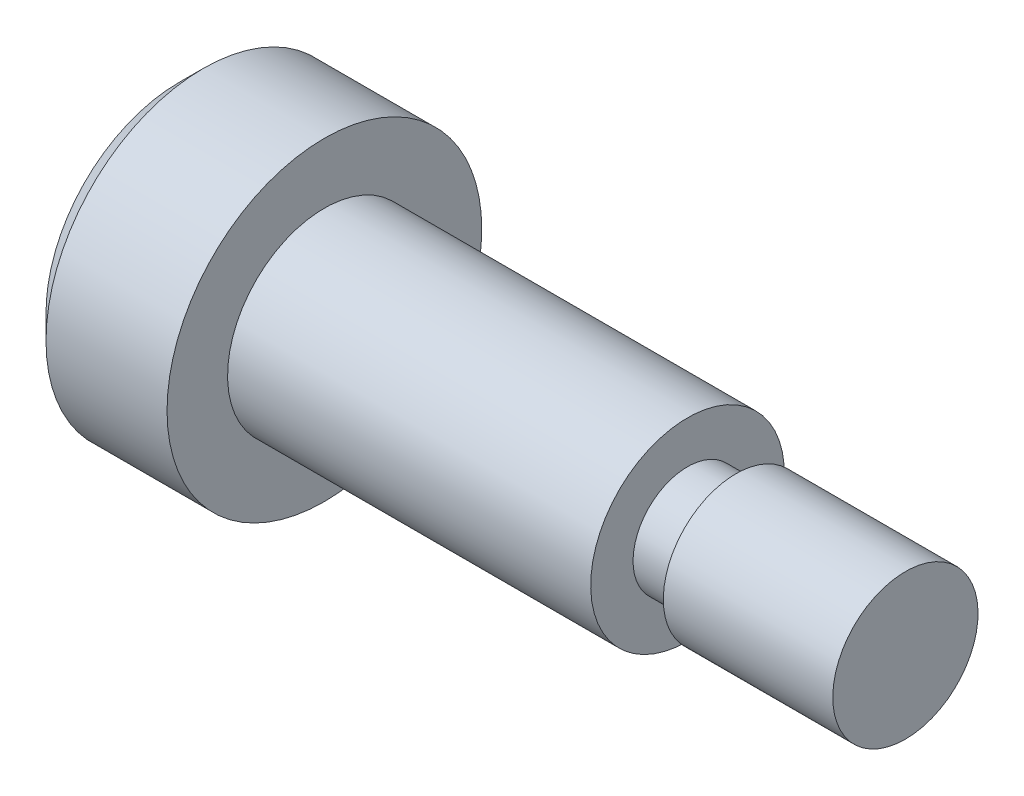
ISO-10303-21;
HEADER;
FILE_DESCRIPTION(('STEP AP214'),'2;1');
FILE_NAME('part.step','',(''),(''),'','','');
FILE_SCHEMA(('AUTOMOTIVE_DESIGN { 1 0 10303 214 1 1 1 1 }'));
ENDSEC;
DATA;
#1=APPLICATION_CONTEXT('core data for automotive mechanical design processes');
#2=APPLICATION_PROTOCOL_DEFINITION('international standard','automotive_design',2000,#1);
#3=PRODUCT_CONTEXT('',#1,'mechanical');
#4=PRODUCT('Part','Part','',(#3));
#5=PRODUCT_RELATED_PRODUCT_CATEGORY('part','',(#4));
#6=PRODUCT_DEFINITION_FORMATION('','',#4);
#7=PRODUCT_DEFINITION_CONTEXT('part definition',#1,'design');
#8=PRODUCT_DEFINITION('design','',#6,#7);
#9=PRODUCT_DEFINITION_SHAPE('','',#8);
#10=(LENGTH_UNIT() NAMED_UNIT(*) SI_UNIT(.MILLI.,.METRE.));
#11=(NAMED_UNIT(*) PLANE_ANGLE_UNIT() SI_UNIT($,.RADIAN.));
#12=(NAMED_UNIT(*) SI_UNIT($,.STERADIAN.) SOLID_ANGLE_UNIT());
#13=UNCERTAINTY_MEASURE_WITH_UNIT(LENGTH_MEASURE(1.E-05),#10,'distance_accuracy_value','');
#14=(GEOMETRIC_REPRESENTATION_CONTEXT(3) GLOBAL_UNCERTAINTY_ASSIGNED_CONTEXT((#13)) GLOBAL_UNIT_ASSIGNED_CONTEXT((#10,
#11,#12)) REPRESENTATION_CONTEXT('',''));
#15=CARTESIAN_POINT('',(0.,0.,0.));
#16=DIRECTION('',(0.,0.,1.));
#17=DIRECTION('',(1.,0.,0.));
#18=AXIS2_PLACEMENT_3D('',#15,#16,#17);
#19=CARTESIAN_POINT('',(-6.,0.,0.));
#20=DIRECTION('',(1.,0.,0.));
#21=DIRECTION('',(0.,1.,0.));
#22=AXIS2_PLACEMENT_3D('',#19,#20,#21);
#23=PLANE('',#22);
#24=CARTESIAN_POINT('',(-6.,0.,0.));
#25=DIRECTION('',(1.,0.,0.));
#26=DIRECTION('',(0.,1.,0.));
#27=AXIS2_PLACEMENT_3D('',#24,#25,#26);
#28=CIRCLE('',#27,5.5);
#29=CARTESIAN_POINT('',(-6.,5.5,0.));
#30=VERTEX_POINT('',#29);
#31=EDGE_CURVE('E40',#30,#30,#28,.F.);
#32=ORIENTED_EDGE('',*,*,#31,.T.);
#33=EDGE_LOOP('',(#32));
#34=FACE_BOUND('',#33,.T.);
#35=DIRECTION('',(0.,0.866025403784438,-0.5));
#36=VECTOR('',#35,1.);
#37=CARTESIAN_POINT('',(-6.,0.,2.88675134594813));
#38=LINE('',#37,#36);
#39=CARTESIAN_POINT('',(-6.,0.,2.88675134594813));
#40=VERTEX_POINT('',#39);
#41=CARTESIAN_POINT('',(-6.,2.5,1.44337567297406));
#42=VERTEX_POINT('',#41);
#43=EDGE_CURVE('E121',#40,#42,#38,.T.);
#44=ORIENTED_EDGE('',*,*,#43,.F.);
#45=DIRECTION('',(0.,0.866025403784438,0.5));
#46=VECTOR('',#45,1.);
#47=CARTESIAN_POINT('',(-6.,-2.5,1.44337567297406));
#48=LINE('',#47,#46);
#49=CARTESIAN_POINT('',(-6.,-2.5,1.44337567297406));
#50=VERTEX_POINT('',#49);
#51=EDGE_CURVE('E47',#50,#40,#48,.T.);
#52=ORIENTED_EDGE('',*,*,#51,.F.);
#53=DIRECTION('',(0.,0.,1.));
#54=VECTOR('',#53,1.);
#55=CARTESIAN_POINT('',(-6.,-2.5,-1.44337567297407));
#56=LINE('',#55,#54);
#57=CARTESIAN_POINT('',(-6.,-2.5,-1.44337567297407));
#58=VERTEX_POINT('',#57);
#59=EDGE_CURVE('E130',#58,#50,#56,.T.);
#60=ORIENTED_EDGE('',*,*,#59,.F.);
#61=DIRECTION('',(0.,-0.866025403784439,0.5));
#62=VECTOR('',#61,1.);
#63=CARTESIAN_POINT('',(-6.,0.,-2.88675134594813));
#64=LINE('',#63,#62);
#65=CARTESIAN_POINT('',(-6.,0.,-2.88675134594813));
#66=VERTEX_POINT('',#65);
#67=EDGE_CURVE('E128',#66,#58,#64,.T.);
#68=ORIENTED_EDGE('',*,*,#67,.F.);
#69=DIRECTION('',(0.,-0.866025403784439,-0.5));
#70=VECTOR('',#69,1.);
#71=CARTESIAN_POINT('',(-6.,2.5,-1.44337567297407));
#72=LINE('',#71,#70);
#73=CARTESIAN_POINT('',(-6.,2.5,-1.44337567297407));
#74=VERTEX_POINT('',#73);
#75=EDGE_CURVE('E95',#74,#66,#72,.T.);
#76=ORIENTED_EDGE('',*,*,#75,.F.);
#77=DIRECTION('',(0.,0.,-1.));
#78=VECTOR('',#77,1.);
#79=CARTESIAN_POINT('',(-6.,2.5,1.44337567297406));
#80=LINE('',#79,#78);
#81=EDGE_CURVE('E124',#42,#74,#80,.T.);
#82=ORIENTED_EDGE('',*,*,#81,.F.);
#83=EDGE_LOOP('',(#44,#52,#60,#68,#76,#82));
#84=FACE_BOUND('',#83,.T.);
#85=ADVANCED_FACE('F32',(#34,#84),#23,.F.);
#86=CARTESIAN_POINT('',(-26.0125543283678,0.,0.));
#87=DIRECTION('',(-1.,0.,0.));
#88=DIRECTION('',(0.,-1.,0.));
#89=AXIS2_PLACEMENT_3D('',#86,#87,#88);
#90=CYLINDRICAL_SURFACE('',#89,6.5);
#91=CARTESIAN_POINT('',(-4.99999999999999,0.,0.));
#92=DIRECTION('',(1.,0.,0.));
#93=DIRECTION('',(0.,1.,0.));
#94=AXIS2_PLACEMENT_3D('',#91,#92,#93);
#95=CIRCLE('',#94,6.5);
#96=CARTESIAN_POINT('',(-4.99999999999999,6.5,0.));
#97=VERTEX_POINT('',#96);
#98=EDGE_CURVE('E11',#97,#97,#95,.T.);
#99=ORIENTED_EDGE('',*,*,#98,.T.);
#100=EDGE_LOOP('',(#99));
#101=FACE_BOUND('',#100,.T.);
#102=CARTESIAN_POINT('',(0.,0.,0.));
#103=DIRECTION('',(-1.,0.,0.));
#104=DIRECTION('',(0.,-1.,0.));
#105=AXIS2_PLACEMENT_3D('',#102,#103,#104);
#106=CIRCLE('',#105,6.5);
#107=CARTESIAN_POINT('',(0.,-6.5,0.));
#108=VERTEX_POINT('',#107);
#109=EDGE_CURVE('E157',#108,#108,#106,.T.);
#110=ORIENTED_EDGE('',*,*,#109,.T.);
#111=EDGE_LOOP('',(#110));
#112=FACE_BOUND('',#111,.T.);
#113=ADVANCED_FACE('F173',(#101,#112),#90,.T.);
#114=CARTESIAN_POINT('',(0.,6.5,0.));
#115=DIRECTION('',(-1.,0.,0.));
#116=DIRECTION('',(0.,-1.,0.));
#117=AXIS2_PLACEMENT_3D('',#114,#115,#116);
#118=PLANE('',#117);
#119=ORIENTED_EDGE('',*,*,#109,.F.);
#120=EDGE_LOOP('',(#119));
#121=FACE_BOUND('',#120,.T.);
#122=CARTESIAN_POINT('',(0.,0.,0.));
#123=DIRECTION('',(-1.,0.,0.));
#124=DIRECTION('',(0.,-1.,0.));
#125=AXIS2_PLACEMENT_3D('',#122,#123,#124);
#126=CIRCLE('',#125,4.);
#127=CARTESIAN_POINT('',(0.,-4.,0.));
#128=VERTEX_POINT('',#127);
#129=EDGE_CURVE('E154',#128,#128,#126,.T.);
#130=ORIENTED_EDGE('',*,*,#129,.T.);
#131=EDGE_LOOP('',(#130));
#132=FACE_BOUND('',#131,.T.);
#133=ADVANCED_FACE('F177',(#121,#132),#118,.F.);
#134=CARTESIAN_POINT('',(-26.0125543283678,0.,0.));
#135=DIRECTION('',(-1.,0.,0.));
#136=DIRECTION('',(0.,-1.,0.));
#137=AXIS2_PLACEMENT_3D('',#134,#135,#136);
#138=CYLINDRICAL_SURFACE('',#137,4.);
#139=ORIENTED_EDGE('',*,*,#129,.F.);
#140=EDGE_LOOP('',(#139));
#141=FACE_BOUND('',#140,.T.);
#142=CARTESIAN_POINT('',(15.,0.,0.));
#143=DIRECTION('',(-1.,0.,0.));
#144=DIRECTION('',(0.,-1.,0.));
#145=AXIS2_PLACEMENT_3D('',#142,#143,#144);
#146=CIRCLE('',#145,4.);
#147=CARTESIAN_POINT('',(15.,-4.,0.));
#148=VERTEX_POINT('',#147);
#149=EDGE_CURVE('E151',#148,#148,#146,.T.);
#150=ORIENTED_EDGE('',*,*,#149,.T.);
#151=EDGE_LOOP('',(#150));
#152=FACE_BOUND('',#151,.T.);
#153=ADVANCED_FACE('F183',(#141,#152),#138,.T.);
#154=CARTESIAN_POINT('',(15.,4.,0.));
#155=DIRECTION('',(-1.,0.,0.));
#156=DIRECTION('',(0.,-1.,0.));
#157=AXIS2_PLACEMENT_3D('',#154,#155,#156);
#158=PLANE('',#157);
#159=ORIENTED_EDGE('',*,*,#149,.F.);
#160=EDGE_LOOP('',(#159));
#161=FACE_BOUND('',#160,.T.);
#162=CARTESIAN_POINT('',(15.,0.,0.));
#163=DIRECTION('',(-1.,0.,0.));
#164=DIRECTION('',(0.,-1.,0.));
#165=AXIS2_PLACEMENT_3D('',#162,#163,#164);
#166=CIRCLE('',#165,2.25);
#167=CARTESIAN_POINT('',(15.,-2.25,0.));
#168=VERTEX_POINT('',#167);
#169=EDGE_CURVE('E148',#168,#168,#166,.T.);
#170=ORIENTED_EDGE('',*,*,#169,.T.);
#171=EDGE_LOOP('',(#170));
#172=FACE_BOUND('',#171,.T.);
#173=ADVANCED_FACE('F187',(#161,#172),#158,.F.);
#174=CARTESIAN_POINT('',(-26.0125543283678,0.,0.));
#175=DIRECTION('',(-1.,0.,0.));
#176=DIRECTION('',(0.,-1.,0.));
#177=AXIS2_PLACEMENT_3D('',#174,#175,#176);
#178=CYLINDRICAL_SURFACE('',#177,2.25);
#179=ORIENTED_EDGE('',*,*,#169,.F.);
#180=EDGE_LOOP('',(#179));
#181=FACE_BOUND('',#180,.T.);
#182=CARTESIAN_POINT('',(17.,0.,0.));
#183=DIRECTION('',(-1.,0.,0.));
#184=DIRECTION('',(0.,-1.,0.));
#185=AXIS2_PLACEMENT_3D('',#182,#183,#184);
#186=CIRCLE('',#185,2.25);
#187=CARTESIAN_POINT('',(17.,-2.25,0.));
#188=VERTEX_POINT('',#187);
#189=EDGE_CURVE('E145',#188,#188,#186,.T.);
#190=ORIENTED_EDGE('',*,*,#189,.T.);
#191=EDGE_LOOP('',(#190));
#192=FACE_BOUND('',#191,.T.);
#193=ADVANCED_FACE('F191',(#181,#192),#178,.T.);
#194=CARTESIAN_POINT('',(17.,2.25,0.));
#195=DIRECTION('',(1.,0.,0.));
#196=DIRECTION('',(0.,1.,0.));
#197=AXIS2_PLACEMENT_3D('',#194,#195,#196);
#198=PLANE('',#197);
#199=ORIENTED_EDGE('',*,*,#189,.F.);
#200=EDGE_LOOP('',(#199));
#201=FACE_BOUND('',#200,.T.);
#202=CARTESIAN_POINT('',(17.,0.,0.));
#203=DIRECTION('',(-1.,0.,0.));
#204=DIRECTION('',(0.,-1.,0.));
#205=AXIS2_PLACEMENT_3D('',#202,#203,#204);
#206=CIRCLE('',#205,3.);
#207=CARTESIAN_POINT('',(17.,-3.,0.));
#208=VERTEX_POINT('',#207);
#209=EDGE_CURVE('E142',#208,#208,#206,.T.);
#210=ORIENTED_EDGE('',*,*,#209,.T.);
#211=EDGE_LOOP('',(#210));
#212=FACE_BOUND('',#211,.T.);
#213=ADVANCED_FACE('F195',(#201,#212),#198,.F.);
#214=CARTESIAN_POINT('',(-26.0125543283678,0.,0.));
#215=DIRECTION('',(-1.,0.,0.));
#216=DIRECTION('',(0.,-1.,0.));
#217=AXIS2_PLACEMENT_3D('',#214,#215,#216);
#218=CYLINDRICAL_SURFACE('',#217,3.);
#219=ORIENTED_EDGE('',*,*,#209,.F.);
#220=EDGE_LOOP('',(#219));
#221=FACE_BOUND('',#220,.T.);
#222=CARTESIAN_POINT('',(24.,0.,0.));
#223=DIRECTION('',(-1.,0.,0.));
#224=DIRECTION('',(0.,-1.,0.));
#225=AXIS2_PLACEMENT_3D('',#222,#223,#224);
#226=CIRCLE('',#225,3.);
#227=CARTESIAN_POINT('',(24.,-3.,0.));
#228=VERTEX_POINT('',#227);
#229=EDGE_CURVE('E134',#228,#228,#226,.T.);
#230=ORIENTED_EDGE('',*,*,#229,.T.);
#231=EDGE_LOOP('',(#230));
#232=FACE_BOUND('',#231,.T.);
#233=ADVANCED_FACE('F199',(#221,#232),#218,.T.);
#234=CARTESIAN_POINT('',(24.,3.,0.));
#235=DIRECTION('',(-1.,0.,0.));
#236=DIRECTION('',(0.,-1.,0.));
#237=AXIS2_PLACEMENT_3D('',#234,#235,#236);
#238=PLANE('',#237);
#239=ORIENTED_EDGE('',*,*,#229,.F.);
#240=EDGE_LOOP('',(#239));
#241=FACE_BOUND('',#240,.T.);
#242=ADVANCED_FACE('F203',(#241),#238,.F.);
#243=CARTESIAN_POINT('',(-3.,-2.5,1.44337567297406));
#244=DIRECTION('',(0.,-0.5,0.866025403784439));
#245=DIRECTION('',(0.,-0.866025403784439,-0.5));
#246=AXIS2_PLACEMENT_3D('',#243,#244,#245);
#247=PLANE('',#246);
#248=ORIENTED_EDGE('',*,*,#51,.T.);
#249=DIRECTION('',(-1.,0.,0.));
#250=VECTOR('',#249,1.);
#251=CARTESIAN_POINT('',(-3.,0.,2.88675134594813));
#252=LINE('',#251,#250);
#253=CARTESIAN_POINT('',(-3.,0.,2.88675134594813));
#254=VERTEX_POINT('',#253);
#255=EDGE_CURVE('E77',#254,#40,#252,.T.);
#256=ORIENTED_EDGE('',*,*,#255,.F.);
#257=DIRECTION('',(0.,0.866025403784438,0.5));
#258=VECTOR('',#257,1.);
#259=CARTESIAN_POINT('',(-3.,-2.5,1.44337567297406));
#260=LINE('',#259,#258);
#261=CARTESIAN_POINT('',(-3.,-2.5,1.44337567297406));
#262=VERTEX_POINT('',#261);
#263=EDGE_CURVE('E132',#262,#254,#260,.T.);
#264=ORIENTED_EDGE('',*,*,#263,.F.);
#265=DIRECTION('',(-1.,0.,0.));
#266=VECTOR('',#265,1.);
#267=CARTESIAN_POINT('',(-3.,-2.5,1.44337567297406));
#268=LINE('',#267,#266);
#269=EDGE_CURVE('E55',#262,#50,#268,.T.);
#270=ORIENTED_EDGE('',*,*,#269,.T.);
#271=EDGE_LOOP('',(#248,#256,#264,#270));
#272=FACE_BOUND('',#271,.T.);
#273=ADVANCED_FACE('F207',(#272),#247,.F.);
#274=CARTESIAN_POINT('',(-3.,-2.5,-1.44337567297407));
#275=DIRECTION('',(0.,-1.,0.));
#276=DIRECTION('',(0.,0.,-1.));
#277=AXIS2_PLACEMENT_3D('',#274,#275,#276);
#278=PLANE('',#277);
#279=ORIENTED_EDGE('',*,*,#59,.T.);
#280=ORIENTED_EDGE('',*,*,#269,.F.);
#281=DIRECTION('',(0.,0.,1.));
#282=VECTOR('',#281,1.);
#283=CARTESIAN_POINT('',(-3.,-2.5,-1.44337567297407));
#284=LINE('',#283,#282);
#285=CARTESIAN_POINT('',(-3.,-2.5,-1.44337567297407));
#286=VERTEX_POINT('',#285);
#287=EDGE_CURVE('E107',#286,#262,#284,.T.);
#288=ORIENTED_EDGE('',*,*,#287,.F.);
#289=DIRECTION('',(-1.,0.,0.));
#290=VECTOR('',#289,1.);
#291=CARTESIAN_POINT('',(-3.,-2.5,-1.44337567297407));
#292=LINE('',#291,#290);
#293=EDGE_CURVE('E99',#286,#58,#292,.T.);
#294=ORIENTED_EDGE('',*,*,#293,.T.);
#295=EDGE_LOOP('',(#279,#280,#288,#294));
#296=FACE_BOUND('',#295,.T.);
#297=ADVANCED_FACE('F211',(#296),#278,.F.);
#298=CARTESIAN_POINT('',(-3.,0.,-2.88675134594813));
#299=DIRECTION('',(0.,-0.5,-0.866025403784439));
#300=DIRECTION('',(0.,0.866025403784439,-0.5));
#301=AXIS2_PLACEMENT_3D('',#298,#299,#300);
#302=PLANE('',#301);
#303=ORIENTED_EDGE('',*,*,#67,.T.);
#304=ORIENTED_EDGE('',*,*,#293,.F.);
#305=DIRECTION('',(0.,-0.866025403784439,0.5));
#306=VECTOR('',#305,1.);
#307=CARTESIAN_POINT('',(-3.,0.,-2.88675134594813));
#308=LINE('',#307,#306);
#309=CARTESIAN_POINT('',(-3.,0.,-2.88675134594813));
#310=VERTEX_POINT('',#309);
#311=EDGE_CURVE('E103',#310,#286,#308,.T.);
#312=ORIENTED_EDGE('',*,*,#311,.F.);
#313=DIRECTION('',(-1.,0.,0.));
#314=VECTOR('',#313,1.);
#315=CARTESIAN_POINT('',(-3.,0.,-2.88675134594813));
#316=LINE('',#315,#314);
#317=EDGE_CURVE('E88',#310,#66,#316,.T.);
#318=ORIENTED_EDGE('',*,*,#317,.T.);
#319=EDGE_LOOP('',(#303,#304,#312,#318));
#320=FACE_BOUND('',#319,.T.);
#321=ADVANCED_FACE('F104',(#320),#302,.F.);
#322=CARTESIAN_POINT('',(-3.,2.5,-1.44337567297407));
#323=DIRECTION('',(0.,0.5,-0.866025403784439));
#324=DIRECTION('',(0.,0.866025403784439,0.5));
#325=AXIS2_PLACEMENT_3D('',#322,#323,#324);
#326=PLANE('',#325);
#327=ORIENTED_EDGE('',*,*,#75,.T.);
#328=ORIENTED_EDGE('',*,*,#317,.F.);
#329=DIRECTION('',(0.,-0.866025403784439,-0.5));
#330=VECTOR('',#329,1.);
#331=CARTESIAN_POINT('',(-3.,2.5,-1.44337567297407));
#332=LINE('',#331,#330);
#333=CARTESIAN_POINT('',(-3.,2.5,-1.44337567297407));
#334=VERTEX_POINT('',#333);
#335=EDGE_CURVE('E92',#334,#310,#332,.T.);
#336=ORIENTED_EDGE('',*,*,#335,.F.);
#337=DIRECTION('',(-1.,0.,0.));
#338=VECTOR('',#337,1.);
#339=CARTESIAN_POINT('',(-3.,2.5,-1.44337567297407));
#340=LINE('',#339,#338);
#341=EDGE_CURVE('E100',#334,#74,#340,.T.);
#342=ORIENTED_EDGE('',*,*,#341,.T.);
#343=EDGE_LOOP('',(#327,#328,#336,#342));
#344=FACE_BOUND('',#343,.T.);
#345=ADVANCED_FACE('F90',(#344),#326,.F.);
#346=CARTESIAN_POINT('',(-3.,2.5,1.44337567297406));
#347=DIRECTION('',(0.,1.,0.));
#348=DIRECTION('',(0.,0.,1.));
#349=AXIS2_PLACEMENT_3D('',#346,#347,#348);
#350=PLANE('',#349);
#351=ORIENTED_EDGE('',*,*,#81,.T.);
#352=ORIENTED_EDGE('',*,*,#341,.F.);
#353=DIRECTION('',(0.,0.,-1.));
#354=VECTOR('',#353,1.);
#355=CARTESIAN_POINT('',(-3.,2.5,1.44337567297406));
#356=LINE('',#355,#354);
#357=CARTESIAN_POINT('',(-3.,2.5,1.44337567297406));
#358=VERTEX_POINT('',#357);
#359=EDGE_CURVE('E113',#358,#334,#356,.T.);
#360=ORIENTED_EDGE('',*,*,#359,.F.);
#361=DIRECTION('',(-1.,0.,0.));
#362=VECTOR('',#361,1.);
#363=CARTESIAN_POINT('',(-3.,2.5,1.44337567297406));
#364=LINE('',#363,#362);
#365=EDGE_CURVE('E137',#358,#42,#364,.T.);
#366=ORIENTED_EDGE('',*,*,#365,.T.);
#367=EDGE_LOOP('',(#351,#352,#360,#366));
#368=FACE_BOUND('',#367,.T.);
#369=ADVANCED_FACE('F214',(#368),#350,.F.);
#370=CARTESIAN_POINT('',(-3.,0.,2.88675134594813));
#371=DIRECTION('',(0.,0.5,0.866025403784439));
#372=DIRECTION('',(0.,-0.866025403784439,0.5));
#373=AXIS2_PLACEMENT_3D('',#370,#371,#372);
#374=PLANE('',#373);
#375=ORIENTED_EDGE('',*,*,#43,.T.);
#376=ORIENTED_EDGE('',*,*,#365,.F.);
#377=DIRECTION('',(0.,0.866025403784438,-0.5));
#378=VECTOR('',#377,1.);
#379=CARTESIAN_POINT('',(-3.,0.,2.88675134594813));
#380=LINE('',#379,#378);
#381=EDGE_CURVE('E115',#254,#358,#380,.T.);
#382=ORIENTED_EDGE('',*,*,#381,.F.);
#383=ORIENTED_EDGE('',*,*,#255,.T.);
#384=EDGE_LOOP('',(#375,#376,#382,#383));
#385=FACE_BOUND('',#384,.T.);
#386=ADVANCED_FACE('F169',(#385),#374,.F.);
#387=CARTESIAN_POINT('',(-3.,0.,2.88675134594813));
#388=DIRECTION('',(-1.,0.,0.));
#389=DIRECTION('',(0.,0.,1.));
#390=AXIS2_PLACEMENT_3D('',#387,#388,#389);
#391=PLANE('',#390);
#392=ORIENTED_EDGE('',*,*,#263,.T.);
#393=ORIENTED_EDGE('',*,*,#381,.T.);
#394=ORIENTED_EDGE('',*,*,#359,.T.);
#395=ORIENTED_EDGE('',*,*,#335,.T.);
#396=ORIENTED_EDGE('',*,*,#311,.T.);
#397=ORIENTED_EDGE('',*,*,#287,.T.);
#398=EDGE_LOOP('',(#392,#393,#394,#395,#396,#397));
#399=FACE_BOUND('',#398,.T.);
#400=ADVANCED_FACE('F110',(#399),#391,.T.);
#401=CARTESIAN_POINT('',(-6.,0.,0.));
#402=DIRECTION('',(1.,0.,0.));
#403=DIRECTION('',(0.,1.,0.));
#404=AXIS2_PLACEMENT_3D('',#401,#402,#403);
#405=CONICAL_SURFACE('',#404,5.5,0.785398163397447);
#406=ORIENTED_EDGE('',*,*,#98,.F.);
#407=EDGE_LOOP('',(#406));
#408=FACE_BOUND('',#407,.T.);
#409=ORIENTED_EDGE('',*,*,#31,.F.);
#410=EDGE_LOOP('',(#409));
#411=FACE_BOUND('',#410,.T.);
#412=ADVANCED_FACE('F34',(#408,#411),#405,.T.);
#413=CLOSED_SHELL('',(#85,#113,#133,#153,#173,#193,#213,#233,#242,#273,#297,#321,#345,#369,#386,
#400,#412));
#414=MANIFOLD_SOLID_BREP('B2',#413);
#415=ADVANCED_BREP_SHAPE_REPRESENTATION('',(#18,#414),#14);
#416=SHAPE_DEFINITION_REPRESENTATION(#9,#415);
ENDSEC;
END-ISO-10303-21;
